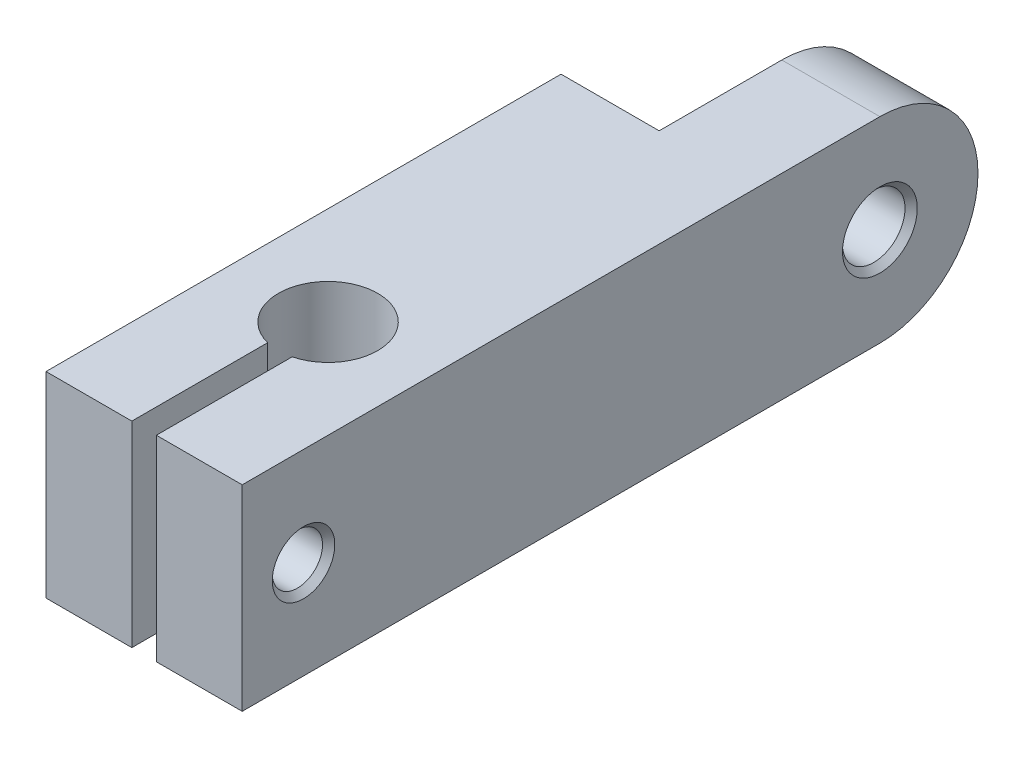
ISO-10303-21;
HEADER;
FILE_DESCRIPTION(('STEP AP214'),'2;1');
FILE_NAME('part.step','',(''),(''),'','','');
FILE_SCHEMA(('AUTOMOTIVE_DESIGN { 1 0 10303 214 1 1 1 1 }'));
ENDSEC;
DATA;
#1=APPLICATION_CONTEXT('core data for automotive mechanical design processes');
#2=APPLICATION_PROTOCOL_DEFINITION('international standard','automotive_design',2000,#1);
#3=PRODUCT_CONTEXT('',#1,'mechanical');
#4=PRODUCT('Part','Part','',(#3));
#5=PRODUCT_RELATED_PRODUCT_CATEGORY('part','',(#4));
#6=PRODUCT_DEFINITION_FORMATION('','',#4);
#7=PRODUCT_DEFINITION_CONTEXT('part definition',#1,'design');
#8=PRODUCT_DEFINITION('design','',#6,#7);
#9=PRODUCT_DEFINITION_SHAPE('','',#8);
#10=(LENGTH_UNIT() NAMED_UNIT(*) SI_UNIT(.MILLI.,.METRE.));
#11=(NAMED_UNIT(*) PLANE_ANGLE_UNIT() SI_UNIT($,.RADIAN.));
#12=(NAMED_UNIT(*) SI_UNIT($,.STERADIAN.) SOLID_ANGLE_UNIT());
#13=UNCERTAINTY_MEASURE_WITH_UNIT(LENGTH_MEASURE(1.E-05),#10,'distance_accuracy_value','');
#14=(GEOMETRIC_REPRESENTATION_CONTEXT(3) GLOBAL_UNCERTAINTY_ASSIGNED_CONTEXT((#13)) GLOBAL_UNIT_ASSIGNED_CONTEXT((#10,
#11,#12)) REPRESENTATION_CONTEXT('',''));
#15=CARTESIAN_POINT('',(0.,0.,0.));
#16=DIRECTION('',(0.,0.,1.));
#17=DIRECTION('',(1.,0.,0.));
#18=AXIS2_PLACEMENT_3D('',#15,#16,#17);
#19=CARTESIAN_POINT('',(8.,8.,60.));
#20=DIRECTION('',(0.,-1.,0.));
#21=DIRECTION('',(1.,0.,0.));
#22=AXIS2_PLACEMENT_3D('',#19,#20,#21);
#23=PLANE('',#22);
#24=DIRECTION('',(-1.,0.,0.));
#25=VECTOR('',#24,1.);
#26=CARTESIAN_POINT('',(8.,8.,8.));
#27=LINE('',#26,#25);
#28=CARTESIAN_POINT('',(8.,8.,8.));
#29=VERTEX_POINT('',#28);
#30=CARTESIAN_POINT('',(0.,8.,8.));
#31=VERTEX_POINT('',#30);
#32=EDGE_CURVE('E125',#29,#31,#27,.T.);
#33=ORIENTED_EDGE('',*,*,#32,.T.);
#34=DIRECTION('',(0.,0.,-1.));
#35=VECTOR('',#34,1.);
#36=CARTESIAN_POINT('',(0.,8.,0.));
#37=LINE('',#36,#35);
#38=CARTESIAN_POINT('',(0.,8.,18.));
#39=VERTEX_POINT('',#38);
#40=EDGE_CURVE('E268',#39,#31,#37,.T.);
#41=ORIENTED_EDGE('',*,*,#40,.F.);
#42=DIRECTION('',(1.,0.,0.));
#43=VECTOR('',#42,1.);
#44=CARTESIAN_POINT('',(-8.,8.,18.));
#45=LINE('',#44,#43);
#46=CARTESIAN_POINT('',(-8.,8.,18.));
#47=VERTEX_POINT('',#46);
#48=EDGE_CURVE('E266',#47,#39,#45,.T.);
#49=ORIENTED_EDGE('',*,*,#48,.F.);
#50=DIRECTION('',(0.,0.,-1.));
#51=VECTOR('',#50,1.);
#52=CARTESIAN_POINT('',(-8.,8.,60.));
#53=LINE('',#52,#51);
#54=CARTESIAN_POINT('',(-8.,8.,60.));
#55=VERTEX_POINT('',#54);
#56=EDGE_CURVE('E149',#55,#47,#53,.T.);
#57=ORIENTED_EDGE('',*,*,#56,.F.);
#58=DIRECTION('',(-1.,0.,0.));
#59=VECTOR('',#58,1.);
#60=CARTESIAN_POINT('',(8.,8.,60.));
#61=LINE('',#60,#59);
#62=CARTESIAN_POINT('',(-0.999999999999996,8.,60.));
#63=VERTEX_POINT('',#62);
#64=EDGE_CURVE('E63',#63,#55,#61,.T.);
#65=ORIENTED_EDGE('',*,*,#64,.F.);
#66=DIRECTION('',(0.,0.,-1.));
#67=VECTOR('',#66,1.);
#68=CARTESIAN_POINT('',(-1.00000000000001,8.,0.));
#69=LINE('',#68,#67);
#70=CARTESIAN_POINT('',(-0.999999999999996,8.,48.9246018906381));
#71=VERTEX_POINT('',#70);
#72=EDGE_CURVE('E56',#63,#71,#69,.T.);
#73=ORIENTED_EDGE('',*,*,#72,.T.);
#74=CARTESIAN_POINT('',(0.,8.,45.));
#75=DIRECTION('',(0.,1.,0.));
#76=DIRECTION('',(-1.,0.,0.));
#77=AXIS2_PLACEMENT_3D('',#74,#75,#76);
#78=CIRCLE('',#77,4.05);
#79=CARTESIAN_POINT('',(1.00000000000001,8.,48.9246018906381));
#80=VERTEX_POINT('',#79);
#81=EDGE_CURVE('E219',#80,#71,#78,.T.);
#82=ORIENTED_EDGE('',*,*,#81,.F.);
#83=DIRECTION('',(0.,0.,-1.));
#84=VECTOR('',#83,1.);
#85=CARTESIAN_POINT('',(1.00000000000001,8.,0.));
#86=LINE('',#85,#84);
#87=CARTESIAN_POINT('',(1.00000000000001,8.,60.));
#88=VERTEX_POINT('',#87);
#89=EDGE_CURVE('E233',#88,#80,#86,.T.);
#90=ORIENTED_EDGE('',*,*,#89,.F.);
#91=CARTESIAN_POINT('',(8.,8.,60.));
#92=VERTEX_POINT('',#91);
#93=EDGE_CURVE('E256',#92,#88,#61,.T.);
#94=ORIENTED_EDGE('',*,*,#93,.F.);
#95=DIRECTION('',(0.,0.,-1.));
#96=VECTOR('',#95,1.);
#97=CARTESIAN_POINT('',(8.,8.,60.));
#98=LINE('',#97,#96);
#99=EDGE_CURVE('E144',#92,#29,#98,.T.);
#100=ORIENTED_EDGE('',*,*,#99,.T.);
#101=EDGE_LOOP('',(#33,#41,#49,#57,#65,#73,#82,#90,#94,#100));
#102=FACE_BOUND('',#101,.T.);
#103=ADVANCED_FACE('F40',(#102),#23,.F.);
#104=CARTESIAN_POINT('',(0.,0.,60.));
#105=DIRECTION('',(0.,0.,1.));
#106=DIRECTION('',(1.,0.,0.));
#107=AXIS2_PLACEMENT_3D('',#104,#105,#106);
#108=PLANE('',#107);
#109=DIRECTION('',(1.,0.,0.));
#110=VECTOR('',#109,1.);
#111=CARTESIAN_POINT('',(8.,-8.,60.));
#112=LINE('',#111,#110);
#113=CARTESIAN_POINT('',(-8.,-8.,60.));
#114=VERTEX_POINT('',#113);
#115=CARTESIAN_POINT('',(-0.999999999999993,-8.,60.));
#116=VERTEX_POINT('',#115);
#117=EDGE_CURVE('E252',#114,#116,#112,.T.);
#118=ORIENTED_EDGE('',*,*,#117,.T.);
#119=DIRECTION('',(0.,1.,0.));
#120=VECTOR('',#119,1.);
#121=CARTESIAN_POINT('',(-0.999999999999993,-8.,60.));
#122=LINE('',#121,#120);
#123=EDGE_CURVE('E247',#116,#63,#122,.T.);
#124=ORIENTED_EDGE('',*,*,#123,.T.);
#125=ORIENTED_EDGE('',*,*,#64,.T.);
#126=DIRECTION('',(0.,-1.,0.));
#127=VECTOR('',#126,1.);
#128=CARTESIAN_POINT('',(-8.,-8.,60.));
#129=LINE('',#128,#127);
#130=EDGE_CURVE('E244',#55,#114,#129,.T.);
#131=ORIENTED_EDGE('',*,*,#130,.T.);
#132=EDGE_LOOP('',(#118,#124,#125,#131));
#133=FACE_BOUND('',#132,.T.);
#134=ADVANCED_FACE('F175',(#133),#108,.T.);
#135=CARTESIAN_POINT('',(-8.,-8.,60.));
#136=DIRECTION('',(1.,0.,0.));
#137=DIRECTION('',(0.,0.,-1.));
#138=AXIS2_PLACEMENT_3D('',#135,#136,#137);
#139=PLANE('',#138);
#140=CARTESIAN_POINT('',(-8.,0.,55.));
#141=DIRECTION('',(-1.,0.,0.));
#142=DIRECTION('',(0.,0.,1.));
#143=AXIS2_PLACEMENT_3D('',#140,#141,#142);
#144=CIRCLE('',#143,1.64999999999999);
#145=CARTESIAN_POINT('',(-8.,0.,56.65));
#146=VERTEX_POINT('',#145);
#147=EDGE_CURVE('E225',#146,#146,#144,.T.);
#148=ORIENTED_EDGE('',*,*,#147,.F.);
#149=EDGE_LOOP('',(#148));
#150=FACE_BOUND('',#149,.T.);
#151=ORIENTED_EDGE('',*,*,#56,.T.);
#152=DIRECTION('',(0.,-1.,0.));
#153=VECTOR('',#152,1.);
#154=CARTESIAN_POINT('',(-8.,0.,18.));
#155=LINE('',#154,#153);
#156=CARTESIAN_POINT('',(-8.,-8.,18.));
#157=VERTEX_POINT('',#156);
#158=EDGE_CURVE('E263',#47,#157,#155,.T.);
#159=ORIENTED_EDGE('',*,*,#158,.T.);
#160=DIRECTION('',(0.,0.,-1.));
#161=VECTOR('',#160,1.);
#162=CARTESIAN_POINT('',(-8.,-8.,60.));
#163=LINE('',#162,#161);
#164=EDGE_CURVE('E143',#114,#157,#163,.T.);
#165=ORIENTED_EDGE('',*,*,#164,.F.);
#166=ORIENTED_EDGE('',*,*,#130,.F.);
#167=EDGE_LOOP('',(#151,#159,#165,#166));
#168=FACE_BOUND('',#167,.T.);
#169=ADVANCED_FACE('F181',(#150,#168),#139,.F.);
#170=CARTESIAN_POINT('',(8.,-8.,60.));
#171=DIRECTION('',(0.,1.,0.));
#172=DIRECTION('',(-1.,0.,0.));
#173=AXIS2_PLACEMENT_3D('',#170,#171,#172);
#174=PLANE('',#173);
#175=DIRECTION('',(0.,0.,-1.));
#176=VECTOR('',#175,1.);
#177=CARTESIAN_POINT('',(0.,-8.,0.));
#178=LINE('',#177,#176);
#179=CARTESIAN_POINT('',(0.,-8.,18.));
#180=VERTEX_POINT('',#179);
#181=CARTESIAN_POINT('',(0.,-8.,8.));
#182=VERTEX_POINT('',#181);
#183=EDGE_CURVE('E139',#180,#182,#178,.T.);
#184=ORIENTED_EDGE('',*,*,#183,.T.);
#185=DIRECTION('',(-1.,0.,0.));
#186=VECTOR('',#185,1.);
#187=CARTESIAN_POINT('',(8.,-8.,8.));
#188=LINE('',#187,#186);
#189=CARTESIAN_POINT('',(8.,-8.,8.));
#190=VERTEX_POINT('',#189);
#191=EDGE_CURVE('E122',#190,#182,#188,.T.);
#192=ORIENTED_EDGE('',*,*,#191,.F.);
#193=DIRECTION('',(0.,0.,-1.));
#194=VECTOR('',#193,1.);
#195=CARTESIAN_POINT('',(8.,-8.,60.));
#196=LINE('',#195,#194);
#197=CARTESIAN_POINT('',(8.,-8.,60.));
#198=VERTEX_POINT('',#197);
#199=EDGE_CURVE('E136',#198,#190,#196,.T.);
#200=ORIENTED_EDGE('',*,*,#199,.F.);
#201=CARTESIAN_POINT('',(1.00000000000001,-8.,60.));
#202=VERTEX_POINT('',#201);
#203=EDGE_CURVE('E251',#202,#198,#112,.T.);
#204=ORIENTED_EDGE('',*,*,#203,.F.);
#205=DIRECTION('',(0.,0.,-1.));
#206=VECTOR('',#205,1.);
#207=CARTESIAN_POINT('',(1.00000000000001,-8.,0.));
#208=LINE('',#207,#206);
#209=CARTESIAN_POINT('',(1.00000000000001,-8.,48.9246018906381));
#210=VERTEX_POINT('',#209);
#211=EDGE_CURVE('E235',#202,#210,#208,.T.);
#212=ORIENTED_EDGE('',*,*,#211,.T.);
#213=CARTESIAN_POINT('',(0.,-8.,45.));
#214=DIRECTION('',(0.,1.,0.));
#215=DIRECTION('',(-1.,0.,0.));
#216=AXIS2_PLACEMENT_3D('',#213,#214,#215);
#217=CIRCLE('',#216,4.05);
#218=CARTESIAN_POINT('',(-0.999999999999994,-8.,48.9246018906381));
#219=VERTEX_POINT('',#218);
#220=EDGE_CURVE('E229',#210,#219,#217,.T.);
#221=ORIENTED_EDGE('',*,*,#220,.T.);
#222=DIRECTION('',(0.,0.,-1.));
#223=VECTOR('',#222,1.);
#224=CARTESIAN_POINT('',(-1.00000000000001,-8.,0.));
#225=LINE('',#224,#223);
#226=EDGE_CURVE('E232',#116,#219,#225,.T.);
#227=ORIENTED_EDGE('',*,*,#226,.F.);
#228=ORIENTED_EDGE('',*,*,#117,.F.);
#229=ORIENTED_EDGE('',*,*,#164,.T.);
#230=DIRECTION('',(1.,0.,0.));
#231=VECTOR('',#230,1.);
#232=CARTESIAN_POINT('',(-8.,-8.,18.));
#233=LINE('',#232,#231);
#234=EDGE_CURVE('E272',#157,#180,#233,.T.);
#235=ORIENTED_EDGE('',*,*,#234,.T.);
#236=EDGE_LOOP('',(#184,#192,#200,#204,#212,#221,#227,#228,#229,#235));
#237=FACE_BOUND('',#236,.T.);
#238=ADVANCED_FACE('F134',(#237),#174,.F.);
#239=CARTESIAN_POINT('',(8.,-8.,60.));
#240=DIRECTION('',(-1.,0.,0.));
#241=DIRECTION('',(0.,0.,1.));
#242=AXIS2_PLACEMENT_3D('',#239,#240,#241);
#243=PLANE('',#242);
#244=CARTESIAN_POINT('',(8.,0.,8.));
#245=DIRECTION('',(-1.,0.,0.));
#246=DIRECTION('',(0.,0.,1.));
#247=AXIS2_PLACEMENT_3D('',#244,#245,#246);
#248=CIRCLE('',#247,3.05);
#249=CARTESIAN_POINT('',(8.,0.,11.05));
#250=VERTEX_POINT('',#249);
#251=EDGE_CURVE('E11',#250,#250,#248,.T.);
#252=ORIENTED_EDGE('',*,*,#251,.T.);
#253=EDGE_LOOP('',(#252));
#254=FACE_BOUND('',#253,.T.);
#255=CARTESIAN_POINT('',(8.,0.,55.));
#256=DIRECTION('',(-1.,0.,0.));
#257=DIRECTION('',(0.,0.,1.));
#258=AXIS2_PLACEMENT_3D('',#255,#256,#257);
#259=CIRCLE('',#258,2.55000000000002);
#260=CARTESIAN_POINT('',(8.,0.,57.55));
#261=VERTEX_POINT('',#260);
#262=EDGE_CURVE('E155',#261,#261,#259,.T.);
#263=ORIENTED_EDGE('',*,*,#262,.T.);
#264=EDGE_LOOP('',(#263));
#265=FACE_BOUND('',#264,.T.);
#266=ORIENTED_EDGE('',*,*,#199,.T.);
#267=CARTESIAN_POINT('',(8.,0.,8.));
#268=DIRECTION('',(1.,0.,0.));
#269=DIRECTION('',(0.,0.,-1.));
#270=AXIS2_PLACEMENT_3D('',#267,#268,#269);
#271=CIRCLE('',#270,8.);
#272=EDGE_CURVE('E119',#190,#29,#271,.T.);
#273=ORIENTED_EDGE('',*,*,#272,.T.);
#274=ORIENTED_EDGE('',*,*,#99,.F.);
#275=DIRECTION('',(0.,1.,0.));
#276=VECTOR('',#275,1.);
#277=CARTESIAN_POINT('',(8.,-8.,60.));
#278=LINE('',#277,#276);
#279=EDGE_CURVE('E142',#198,#92,#278,.T.);
#280=ORIENTED_EDGE('',*,*,#279,.F.);
#281=EDGE_LOOP('',(#266,#273,#274,#280));
#282=FACE_BOUND('',#281,.T.);
#283=ADVANCED_FACE('F141',(#254,#265,#282),#243,.F.);
#284=DIRECTION('',(0.,1.,0.));
#285=VECTOR('',#284,1.);
#286=CARTESIAN_POINT('',(1.00000000000001,-8.,60.));
#287=LINE('',#286,#285);
#288=EDGE_CURVE('E245',#202,#88,#287,.T.);
#289=ORIENTED_EDGE('',*,*,#288,.F.);
#290=ORIENTED_EDGE('',*,*,#203,.T.);
#291=ORIENTED_EDGE('',*,*,#279,.T.);
#292=ORIENTED_EDGE('',*,*,#93,.T.);
#293=EDGE_LOOP('',(#289,#290,#291,#292));
#294=FACE_BOUND('',#293,.T.);
#295=ADVANCED_FACE('F183',(#294),#108,.T.);
#296=CARTESIAN_POINT('',(0.,-8.,45.));
#297=DIRECTION('',(0.,1.,0.));
#298=DIRECTION('',(-1.,0.,0.));
#299=AXIS2_PLACEMENT_3D('',#296,#297,#298);
#300=CYLINDRICAL_SURFACE('',#299,4.05);
#301=ORIENTED_EDGE('',*,*,#81,.T.);
#302=DIRECTION('',(0.,1.,0.));
#303=VECTOR('',#302,1.);
#304=CARTESIAN_POINT('',(-0.999999999999994,-8.,48.9246018906381));
#305=LINE('',#304,#303);
#306=EDGE_CURVE('E237',#219,#71,#305,.T.);
#307=ORIENTED_EDGE('',*,*,#306,.F.);
#308=ORIENTED_EDGE('',*,*,#220,.F.);
#309=DIRECTION('',(0.,1.,0.));
#310=VECTOR('',#309,1.);
#311=CARTESIAN_POINT('',(1.00000000000001,-8.,48.9246018906381));
#312=LINE('',#311,#310);
#313=EDGE_CURVE('E242',#210,#80,#312,.T.);
#314=ORIENTED_EDGE('',*,*,#313,.T.);
#315=EDGE_LOOP('',(#301,#307,#308,#314));
#316=FACE_BOUND('',#315,.T.);
#317=ADVANCED_FACE('F291',(#316),#300,.F.);
#318=CARTESIAN_POINT('',(1.00000000000001,-8.,0.));
#319=DIRECTION('',(1.,0.,0.));
#320=DIRECTION('',(0.,1.,0.));
#321=AXIS2_PLACEMENT_3D('',#318,#319,#320);
#322=PLANE('',#321);
#323=CARTESIAN_POINT('',(1.00000000000001,0.,55.));
#324=DIRECTION('',(1.,0.,0.));
#325=DIRECTION('',(0.,1.,0.));
#326=AXIS2_PLACEMENT_3D('',#323,#324,#325);
#327=CIRCLE('',#326,2.05);
#328=CARTESIAN_POINT('',(1.00000000000001,2.05,55.));
#329=VERTEX_POINT('',#328);
#330=EDGE_CURVE('E217',#329,#329,#327,.F.);
#331=ORIENTED_EDGE('',*,*,#330,.F.);
#332=EDGE_LOOP('',(#331));
#333=FACE_BOUND('',#332,.T.);
#334=ORIENTED_EDGE('',*,*,#89,.T.);
#335=ORIENTED_EDGE('',*,*,#313,.F.);
#336=ORIENTED_EDGE('',*,*,#211,.F.);
#337=ORIENTED_EDGE('',*,*,#288,.T.);
#338=EDGE_LOOP('',(#334,#335,#336,#337));
#339=FACE_BOUND('',#338,.T.);
#340=ADVANCED_FACE('F295',(#333,#339),#322,.F.);
#341=CARTESIAN_POINT('',(-1.00000000000001,-8.,0.));
#342=DIRECTION('',(1.,0.,0.));
#343=DIRECTION('',(0.,0.,-1.));
#344=AXIS2_PLACEMENT_3D('',#341,#342,#343);
#345=PLANE('',#344);
#346=CARTESIAN_POINT('',(-0.999999999999994,0.,55.));
#347=DIRECTION('',(1.,0.,0.));
#348=DIRECTION('',(0.,0.,-1.));
#349=AXIS2_PLACEMENT_3D('',#346,#347,#348);
#350=CIRCLE('',#349,1.64999999999999);
#351=CARTESIAN_POINT('',(-0.999999999999994,0.,53.35));
#352=VERTEX_POINT('',#351);
#353=EDGE_CURVE('E220',#352,#352,#350,.T.);
#354=ORIENTED_EDGE('',*,*,#353,.F.);
#355=EDGE_LOOP('',(#354));
#356=FACE_BOUND('',#355,.T.);
#357=ORIENTED_EDGE('',*,*,#72,.F.);
#358=ORIENTED_EDGE('',*,*,#123,.F.);
#359=ORIENTED_EDGE('',*,*,#226,.T.);
#360=ORIENTED_EDGE('',*,*,#306,.T.);
#361=EDGE_LOOP('',(#357,#358,#359,#360));
#362=FACE_BOUND('',#361,.T.);
#363=ADVANCED_FACE('F208',(#356,#362),#345,.T.);
#364=CARTESIAN_POINT('',(-8.001,0.,55.));
#365=DIRECTION('',(1.,0.,0.));
#366=DIRECTION('',(0.,0.,-1.));
#367=AXIS2_PLACEMENT_3D('',#364,#365,#366);
#368=CYLINDRICAL_SURFACE('',#367,2.05);
#369=CARTESIAN_POINT('',(7.49999999999998,0.,55.));
#370=DIRECTION('',(-1.,0.,0.));
#371=DIRECTION('',(0.,0.,1.));
#372=AXIS2_PLACEMENT_3D('',#369,#370,#371);
#373=CIRCLE('',#372,2.05);
#374=CARTESIAN_POINT('',(7.49999999999998,0.,57.05));
#375=VERTEX_POINT('',#374);
#376=EDGE_CURVE('E147',#375,#375,#373,.F.);
#377=ORIENTED_EDGE('',*,*,#376,.T.);
#378=EDGE_LOOP('',(#377));
#379=FACE_BOUND('',#378,.T.);
#380=ORIENTED_EDGE('',*,*,#330,.T.);
#381=EDGE_LOOP('',(#380));
#382=FACE_BOUND('',#381,.T.);
#383=ADVANCED_FACE('F199',(#379,#382),#368,.F.);
#384=CARTESIAN_POINT('',(7.49999999999998,0.,55.));
#385=DIRECTION('',(1.,0.,0.));
#386=DIRECTION('',(0.,0.,-1.));
#387=AXIS2_PLACEMENT_3D('',#384,#385,#386);
#388=CONICAL_SURFACE('',#387,2.05,0.785398163397447);
#389=ORIENTED_EDGE('',*,*,#262,.F.);
#390=EDGE_LOOP('',(#389));
#391=FACE_BOUND('',#390,.T.);
#392=ORIENTED_EDGE('',*,*,#376,.F.);
#393=EDGE_LOOP('',(#392));
#394=FACE_BOUND('',#393,.T.);
#395=ADVANCED_FACE('F194',(#391,#394),#388,.F.);
#396=CARTESIAN_POINT('',(-8.,0.,55.));
#397=DIRECTION('',(-1.,0.,0.));
#398=DIRECTION('',(0.,0.,1.));
#399=AXIS2_PLACEMENT_3D('',#396,#397,#398);
#400=CYLINDRICAL_SURFACE('',#399,1.64999999999999);
#401=ORIENTED_EDGE('',*,*,#353,.T.);
#402=EDGE_LOOP('',(#401));
#403=FACE_BOUND('',#402,.T.);
#404=ORIENTED_EDGE('',*,*,#147,.T.);
#405=EDGE_LOOP('',(#404));
#406=FACE_BOUND('',#405,.T.);
#407=ADVANCED_FACE('F198',(#403,#406),#400,.F.);
#408=CARTESIAN_POINT('',(0.,0.,0.));
#409=DIRECTION('',(1.,0.,0.));
#410=DIRECTION('',(0.,0.,-1.));
#411=AXIS2_PLACEMENT_3D('',#408,#409,#410);
#412=PLANE('',#411);
#413=CARTESIAN_POINT('',(0.,0.,8.));
#414=DIRECTION('',(1.,0.,0.));
#415=DIRECTION('',(0.,0.,-1.));
#416=AXIS2_PLACEMENT_3D('',#413,#414,#415);
#417=CIRCLE('',#416,2.55);
#418=CARTESIAN_POINT('',(0.,0.,5.45));
#419=VERTEX_POINT('',#418);
#420=EDGE_CURVE('E130',#419,#419,#417,.T.);
#421=ORIENTED_EDGE('',*,*,#420,.T.);
#422=EDGE_LOOP('',(#421));
#423=FACE_BOUND('',#422,.T.);
#424=CARTESIAN_POINT('',(0.,0.,8.));
#425=DIRECTION('',(1.,0.,0.));
#426=DIRECTION('',(0.,0.,-1.));
#427=AXIS2_PLACEMENT_3D('',#424,#425,#426);
#428=CIRCLE('',#427,8.);
#429=EDGE_CURVE('E158',#31,#182,#428,.F.);
#430=ORIENTED_EDGE('',*,*,#429,.T.);
#431=ORIENTED_EDGE('',*,*,#183,.F.);
#432=DIRECTION('',(0.,-1.,0.));
#433=VECTOR('',#432,1.);
#434=CARTESIAN_POINT('',(0.,0.,18.));
#435=LINE('',#434,#433);
#436=EDGE_CURVE('E275',#39,#180,#435,.T.);
#437=ORIENTED_EDGE('',*,*,#436,.F.);
#438=ORIENTED_EDGE('',*,*,#40,.T.);
#439=EDGE_LOOP('',(#430,#431,#437,#438));
#440=FACE_BOUND('',#439,.T.);
#441=ADVANCED_FACE('F205',(#423,#440),#412,.F.);
#442=CARTESIAN_POINT('',(-8.,0.,18.));
#443=DIRECTION('',(0.,0.,1.));
#444=DIRECTION('',(0.,-1.,0.));
#445=AXIS2_PLACEMENT_3D('',#442,#443,#444);
#446=PLANE('',#445);
#447=ORIENTED_EDGE('',*,*,#436,.T.);
#448=ORIENTED_EDGE('',*,*,#234,.F.);
#449=ORIENTED_EDGE('',*,*,#158,.F.);
#450=ORIENTED_EDGE('',*,*,#48,.T.);
#451=EDGE_LOOP('',(#447,#448,#449,#450));
#452=FACE_BOUND('',#451,.T.);
#453=ADVANCED_FACE('F286',(#452),#446,.F.);
#454=CARTESIAN_POINT('',(8.,0.,8.));
#455=DIRECTION('',(-1.,0.,0.));
#456=DIRECTION('',(0.,0.,1.));
#457=AXIS2_PLACEMENT_3D('',#454,#455,#456);
#458=CYLINDRICAL_SURFACE('',#457,8.);
#459=ORIENTED_EDGE('',*,*,#429,.F.);
#460=ORIENTED_EDGE('',*,*,#32,.F.);
#461=ORIENTED_EDGE('',*,*,#272,.F.);
#462=ORIENTED_EDGE('',*,*,#191,.T.);
#463=EDGE_LOOP('',(#459,#460,#461,#462));
#464=FACE_BOUND('',#463,.T.);
#465=ADVANCED_FACE('F121',(#464),#458,.T.);
#466=CARTESIAN_POINT('',(-8.,0.,8.));
#467=DIRECTION('',(1.,0.,0.));
#468=DIRECTION('',(0.,0.,-1.));
#469=AXIS2_PLACEMENT_3D('',#466,#467,#468);
#470=CYLINDRICAL_SURFACE('',#469,2.55);
#471=CARTESIAN_POINT('',(7.5,0.,8.));
#472=DIRECTION('',(-1.,0.,0.));
#473=DIRECTION('',(0.,0.,1.));
#474=AXIS2_PLACEMENT_3D('',#471,#472,#473);
#475=CIRCLE('',#474,2.55);
#476=CARTESIAN_POINT('',(7.5,0.,10.55));
#477=VERTEX_POINT('',#476);
#478=EDGE_CURVE('E49',#477,#477,#475,.F.);
#479=ORIENTED_EDGE('',*,*,#478,.T.);
#480=EDGE_LOOP('',(#479));
#481=FACE_BOUND('',#480,.T.);
#482=ORIENTED_EDGE('',*,*,#420,.F.);
#483=EDGE_LOOP('',(#482));
#484=FACE_BOUND('',#483,.T.);
#485=ADVANCED_FACE('F164',(#481,#484),#470,.F.);
#486=CARTESIAN_POINT('',(7.5,0.,8.));
#487=DIRECTION('',(1.,0.,0.));
#488=DIRECTION('',(0.,0.,-1.));
#489=AXIS2_PLACEMENT_3D('',#486,#487,#488);
#490=CONICAL_SURFACE('',#489,2.55,0.785398163397446);
#491=ORIENTED_EDGE('',*,*,#251,.F.);
#492=EDGE_LOOP('',(#491));
#493=FACE_BOUND('',#492,.T.);
#494=ORIENTED_EDGE('',*,*,#478,.F.);
#495=EDGE_LOOP('',(#494));
#496=FACE_BOUND('',#495,.T.);
#497=ADVANCED_FACE('F43',(#493,#496),#490,.F.);
#498=CLOSED_SHELL('',(#103,#134,#169,#238,#283,#295,#317,#340,#363,#383,#395,#407,#441,#453,
#465,#485,#497));
#499=MANIFOLD_SOLID_BREP('B2',#498);
#500=ADVANCED_BREP_SHAPE_REPRESENTATION('',(#18,#499),#14);
#501=SHAPE_DEFINITION_REPRESENTATION(#9,#500);
ENDSEC;
END-ISO-10303-21;
